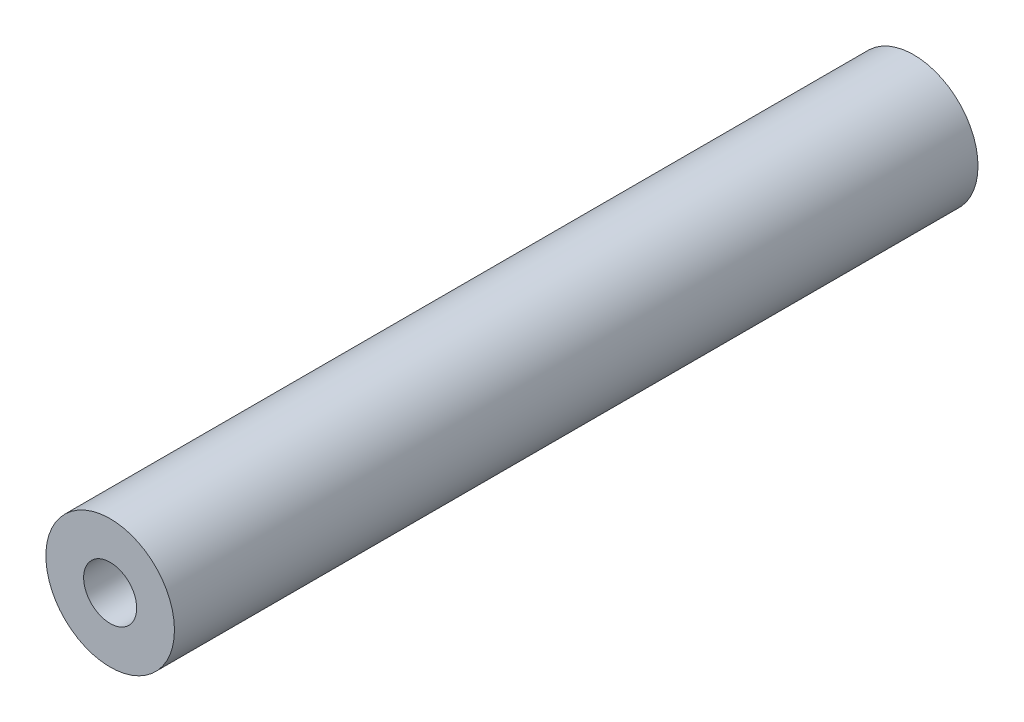
ISO-10303-21;
HEADER;
FILE_DESCRIPTION(('STEP AP214'),'2;1');
FILE_NAME('part.step','',(''),(''),'','','');
FILE_SCHEMA(('AUTOMOTIVE_DESIGN { 1 0 10303 214 1 1 1 1 }'));
ENDSEC;
DATA;
#1=APPLICATION_CONTEXT('core data for automotive mechanical design processes');
#2=APPLICATION_PROTOCOL_DEFINITION('international standard','automotive_design',2000,#1);
#3=PRODUCT_CONTEXT('',#1,'mechanical');
#4=PRODUCT('Part','Part','',(#3));
#5=PRODUCT_RELATED_PRODUCT_CATEGORY('part','',(#4));
#6=PRODUCT_DEFINITION_FORMATION('','',#4);
#7=PRODUCT_DEFINITION_CONTEXT('part definition',#1,'design');
#8=PRODUCT_DEFINITION('design','',#6,#7);
#9=PRODUCT_DEFINITION_SHAPE('','',#8);
#10=(LENGTH_UNIT() NAMED_UNIT(*) SI_UNIT(.MILLI.,.METRE.));
#11=(NAMED_UNIT(*) PLANE_ANGLE_UNIT() SI_UNIT($,.RADIAN.));
#12=(NAMED_UNIT(*) SI_UNIT($,.STERADIAN.) SOLID_ANGLE_UNIT());
#13=UNCERTAINTY_MEASURE_WITH_UNIT(LENGTH_MEASURE(1.E-05),#10,'distance_accuracy_value','');
#14=(GEOMETRIC_REPRESENTATION_CONTEXT(3) GLOBAL_UNCERTAINTY_ASSIGNED_CONTEXT((#13)) GLOBAL_UNIT_ASSIGNED_CONTEXT((#10,
#11,#12)) REPRESENTATION_CONTEXT('',''));
#15=CARTESIAN_POINT('',(0.,0.,0.));
#16=DIRECTION('',(0.,0.,1.));
#17=DIRECTION('',(1.,0.,0.));
#18=AXIS2_PLACEMENT_3D('',#15,#16,#17);
#19=CARTESIAN_POINT('',(0.,0.,25.));
#20=DIRECTION('',(0.,0.,1.));
#21=DIRECTION('',(1.,0.,0.));
#22=AXIS2_PLACEMENT_3D('',#19,#20,#21);
#23=CYLINDRICAL_SURFACE('',#22,4.);
#24=CARTESIAN_POINT('',(0.,0.,50.));
#25=DIRECTION('',(0.,0.,1.));
#26=DIRECTION('',(1.,0.,0.));
#27=AXIS2_PLACEMENT_3D('',#24,#25,#26);
#28=CIRCLE('',#27,4.);
#29=CARTESIAN_POINT('',(4.,0.,50.));
#30=VERTEX_POINT('',#29);
#31=EDGE_CURVE('E9',#30,#30,#28,.T.);
#32=ORIENTED_EDGE('',*,*,#31,.F.);
#33=EDGE_LOOP('',(#32));
#34=FACE_BOUND('',#33,.T.);
#35=CARTESIAN_POINT('',(0.,0.,0.));
#36=DIRECTION('',(0.,0.,1.));
#37=DIRECTION('',(1.,0.,0.));
#38=AXIS2_PLACEMENT_3D('',#35,#36,#37);
#39=CIRCLE('',#38,4.);
#40=CARTESIAN_POINT('',(4.,0.,0.));
#41=VERTEX_POINT('',#40);
#42=EDGE_CURVE('E36',#41,#41,#39,.T.);
#43=ORIENTED_EDGE('',*,*,#42,.T.);
#44=EDGE_LOOP('',(#43));
#45=FACE_BOUND('',#44,.T.);
#46=ADVANCED_FACE('F14',(#34,#45),#23,.T.);
#47=CARTESIAN_POINT('',(0.,0.,50.));
#48=DIRECTION('',(0.,0.,1.));
#49=DIRECTION('',(1.,0.,0.));
#50=AXIS2_PLACEMENT_3D('',#47,#48,#49);
#51=PLANE('',#50);
#52=ORIENTED_EDGE('',*,*,#31,.T.);
#53=EDGE_LOOP('',(#52));
#54=FACE_BOUND('',#53,.T.);
#55=CARTESIAN_POINT('',(0.,0.,50.));
#56=DIRECTION('',(0.,0.,1.));
#57=DIRECTION('',(1.,0.,0.));
#58=AXIS2_PLACEMENT_3D('',#55,#56,#57);
#59=CIRCLE('',#58,1.65);
#60=CARTESIAN_POINT('',(1.65,0.,50.));
#61=VERTEX_POINT('',#60);
#62=EDGE_CURVE('E23',#61,#61,#59,.T.);
#63=ORIENTED_EDGE('',*,*,#62,.F.);
#64=EDGE_LOOP('',(#63));
#65=FACE_BOUND('',#64,.T.);
#66=ADVANCED_FACE('F64',(#54,#65),#51,.T.);
#67=CARTESIAN_POINT('',(0.,0.,42.5));
#68=DIRECTION('',(0.,0.,1.));
#69=DIRECTION('',(1.,0.,0.));
#70=AXIS2_PLACEMENT_3D('',#67,#68,#69);
#71=CYLINDRICAL_SURFACE('',#70,1.65);
#72=CARTESIAN_POINT('',(0.,0.,35.));
#73=DIRECTION('',(0.,0.,1.));
#74=DIRECTION('',(1.,0.,0.));
#75=AXIS2_PLACEMENT_3D('',#72,#73,#74);
#76=CIRCLE('',#75,1.65);
#77=CARTESIAN_POINT('',(1.65,0.,35.));
#78=VERTEX_POINT('',#77);
#79=EDGE_CURVE('E33',#78,#78,#76,.T.);
#80=ORIENTED_EDGE('',*,*,#79,.F.);
#81=EDGE_LOOP('',(#80));
#82=FACE_BOUND('',#81,.T.);
#83=ORIENTED_EDGE('',*,*,#62,.T.);
#84=EDGE_LOOP('',(#83));
#85=FACE_BOUND('',#84,.T.);
#86=ADVANCED_FACE('F70',(#82,#85),#71,.F.);
#87=CARTESIAN_POINT('',(0.,0.,35.));
#88=DIRECTION('',(0.,0.,1.));
#89=DIRECTION('',(1.,0.,0.));
#90=AXIS2_PLACEMENT_3D('',#87,#88,#89);
#91=PLANE('',#90);
#92=ORIENTED_EDGE('',*,*,#79,.T.);
#93=EDGE_LOOP('',(#92));
#94=FACE_BOUND('',#93,.T.);
#95=ADVANCED_FACE('F60',(#94),#91,.T.);
#96=CARTESIAN_POINT('',(0.,0.,0.));
#97=DIRECTION('',(0.,0.,1.));
#98=DIRECTION('',(1.,0.,0.));
#99=AXIS2_PLACEMENT_3D('',#96,#97,#98);
#100=PLANE('',#99);
#101=ORIENTED_EDGE('',*,*,#42,.F.);
#102=EDGE_LOOP('',(#101));
#103=FACE_BOUND('',#102,.T.);
#104=CARTESIAN_POINT('',(0.,0.,0.));
#105=DIRECTION('',(0.,0.,-1.));
#106=DIRECTION('',(1.,0.,0.));
#107=AXIS2_PLACEMENT_3D('',#104,#105,#106);
#108=CIRCLE('',#107,1.65);
#109=CARTESIAN_POINT('',(1.65,0.,0.));
#110=VERTEX_POINT('',#109);
#111=EDGE_CURVE('E38',#110,#110,#108,.T.);
#112=ORIENTED_EDGE('',*,*,#111,.F.);
#113=EDGE_LOOP('',(#112));
#114=FACE_BOUND('',#113,.T.);
#115=ADVANCED_FACE('F54',(#103,#114),#100,.F.);
#116=CARTESIAN_POINT('',(0.,0.,7.5));
#117=DIRECTION('',(0.,0.,-1.));
#118=DIRECTION('',(-1.,0.,0.));
#119=AXIS2_PLACEMENT_3D('',#116,#117,#118);
#120=CYLINDRICAL_SURFACE('',#119,1.65);
#121=CARTESIAN_POINT('',(0.,0.,15.));
#122=DIRECTION('',(0.,0.,-1.));
#123=DIRECTION('',(-1.,0.,0.));
#124=AXIS2_PLACEMENT_3D('',#121,#122,#123);
#125=CIRCLE('',#124,1.65);
#126=CARTESIAN_POINT('',(-1.65,0.,15.));
#127=VERTEX_POINT('',#126);
#128=EDGE_CURVE('E18',#127,#127,#125,.T.);
#129=ORIENTED_EDGE('',*,*,#128,.F.);
#130=EDGE_LOOP('',(#129));
#131=FACE_BOUND('',#130,.T.);
#132=ORIENTED_EDGE('',*,*,#111,.T.);
#133=EDGE_LOOP('',(#132));
#134=FACE_BOUND('',#133,.T.);
#135=ADVANCED_FACE('F52',(#131,#134),#120,.F.);
#136=CARTESIAN_POINT('',(0.,0.,15.));
#137=DIRECTION('',(0.,0.,-1.));
#138=DIRECTION('',(-1.,0.,0.));
#139=AXIS2_PLACEMENT_3D('',#136,#137,#138);
#140=PLANE('',#139);
#141=ORIENTED_EDGE('',*,*,#128,.T.);
#142=EDGE_LOOP('',(#141));
#143=FACE_BOUND('',#142,.T.);
#144=ADVANCED_FACE('F16',(#143),#140,.T.);
#145=CLOSED_SHELL('',(#46,#66,#86,#95,#115,#135,#144));
#146=MANIFOLD_SOLID_BREP('B1',#145);
#147=ADVANCED_BREP_SHAPE_REPRESENTATION('',(#18,#146),#14);
#148=SHAPE_DEFINITION_REPRESENTATION(#9,#147);
ENDSEC;
END-ISO-10303-21;
